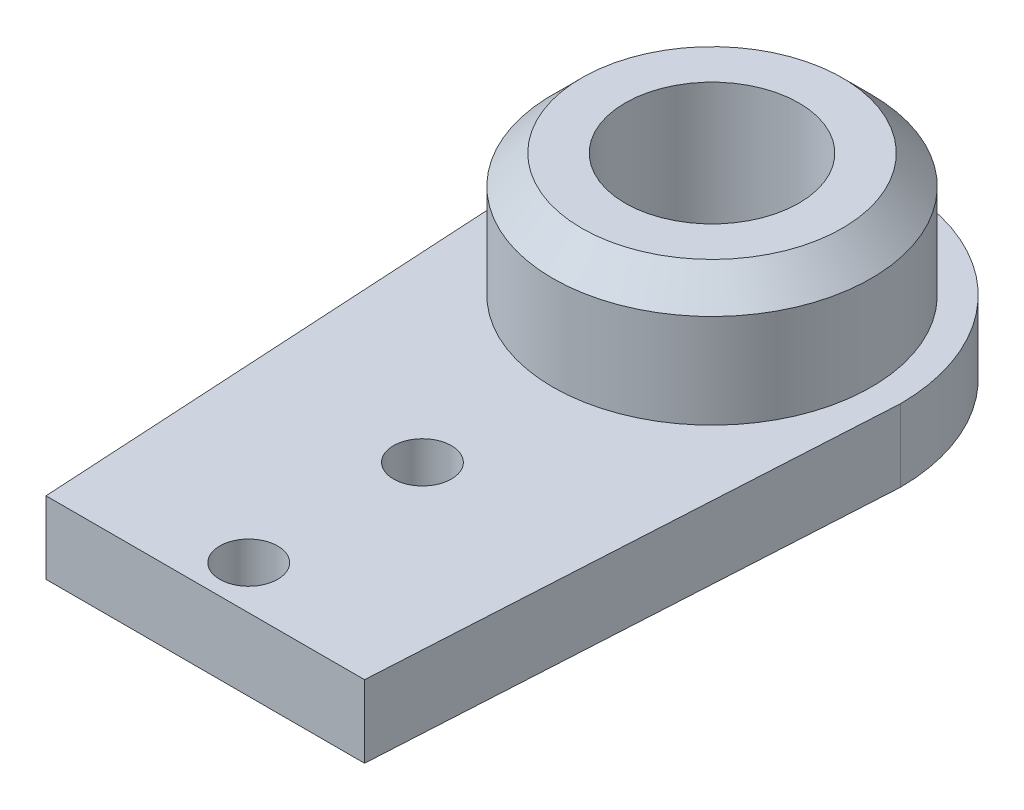
ISO-10303-21;
HEADER;
FILE_DESCRIPTION(('STEP AP214'),'2;1');
FILE_NAME('part.step','',(''),(''),'','','');
FILE_SCHEMA(('AUTOMOTIVE_DESIGN { 1 0 10303 214 1 1 1 1 }'));
ENDSEC;
DATA;
#1=APPLICATION_CONTEXT('core data for automotive mechanical design processes');
#2=APPLICATION_PROTOCOL_DEFINITION('international standard','automotive_design',2000,#1);
#3=PRODUCT_CONTEXT('',#1,'mechanical');
#4=PRODUCT('Part','Part','',(#3));
#5=PRODUCT_RELATED_PRODUCT_CATEGORY('part','',(#4));
#6=PRODUCT_DEFINITION_FORMATION('','',#4);
#7=PRODUCT_DEFINITION_CONTEXT('part definition',#1,'design');
#8=PRODUCT_DEFINITION('design','',#6,#7);
#9=PRODUCT_DEFINITION_SHAPE('','',#8);
#10=(LENGTH_UNIT() NAMED_UNIT(*) SI_UNIT(.MILLI.,.METRE.));
#11=(NAMED_UNIT(*) PLANE_ANGLE_UNIT() SI_UNIT($,.RADIAN.));
#12=(NAMED_UNIT(*) SI_UNIT($,.STERADIAN.) SOLID_ANGLE_UNIT());
#13=UNCERTAINTY_MEASURE_WITH_UNIT(LENGTH_MEASURE(1.E-05),#10,'distance_accuracy_value','');
#14=(GEOMETRIC_REPRESENTATION_CONTEXT(3) GLOBAL_UNCERTAINTY_ASSIGNED_CONTEXT((#13)) GLOBAL_UNIT_ASSIGNED_CONTEXT((#10,
#11,#12)) REPRESENTATION_CONTEXT('',''));
#15=CARTESIAN_POINT('',(0.,0.,0.));
#16=DIRECTION('',(0.,0.,1.));
#17=DIRECTION('',(1.,0.,0.));
#18=AXIS2_PLACEMENT_3D('',#15,#16,#17);
#19=CARTESIAN_POINT('',(0.,2.5,0.));
#20=DIRECTION('',(0.,1.,0.));
#21=DIRECTION('',(0.,0.,1.));
#22=AXIS2_PLACEMENT_3D('',#19,#20,#21);
#23=PLANE('',#22);
#24=CARTESIAN_POINT('',(0.,2.5,16.));
#25=DIRECTION('',(0.,1.,0.));
#26=DIRECTION('',(0.,0.,1.));
#27=AXIS2_PLACEMENT_3D('',#24,#25,#26);
#28=CIRCLE('',#27,1.);
#29=CARTESIAN_POINT('',(0.,2.5,17.));
#30=VERTEX_POINT('',#29);
#31=EDGE_CURVE('E117',#30,#30,#28,.T.);
#32=ORIENTED_EDGE('',*,*,#31,.F.);
#33=EDGE_LOOP('',(#32));
#34=FACE_BOUND('',#33,.T.);
#35=CARTESIAN_POINT('',(0.,2.5,10.));
#36=DIRECTION('',(0.,1.,0.));
#37=DIRECTION('',(0.,0.,1.));
#38=AXIS2_PLACEMENT_3D('',#35,#36,#37);
#39=CIRCLE('',#38,1.);
#40=CARTESIAN_POINT('',(0.,2.5,11.));
#41=VERTEX_POINT('',#40);
#42=EDGE_CURVE('E177',#41,#41,#39,.T.);
#43=ORIENTED_EDGE('',*,*,#42,.F.);
#44=EDGE_LOOP('',(#43));
#45=FACE_BOUND('',#44,.T.);
#46=DIRECTION('',(0.0570497905385129,0.,-0.998371334423977));
#47=VECTOR('',#46,1.);
#48=CARTESIAN_POINT('',(6.47884458909683,2.5,0.370219690805533));
#49=LINE('',#48,#47);
#50=CARTESIAN_POINT('',(5.5,2.5,17.5));
#51=VERTEX_POINT('',#50);
#52=CARTESIAN_POINT('',(6.5,2.5,0.));
#53=VERTEX_POINT('',#52);
#54=EDGE_CURVE('E89',#51,#53,#49,.T.);
#55=ORIENTED_EDGE('',*,*,#54,.T.);
#56=CARTESIAN_POINT('',(0.,2.5,0.));
#57=DIRECTION('',(0.,1.,0.));
#58=DIRECTION('',(0.,0.,1.));
#59=AXIS2_PLACEMENT_3D('',#56,#57,#58);
#60=CIRCLE('',#59,6.5);
#61=CARTESIAN_POINT('',(-6.5,2.5,0.));
#62=VERTEX_POINT('',#61);
#63=EDGE_CURVE('E84',#53,#62,#60,.T.);
#64=ORIENTED_EDGE('',*,*,#63,.T.);
#65=DIRECTION('',(0.0570497905385129,0.,0.998371334423977));
#66=VECTOR('',#65,1.);
#67=CARTESIAN_POINT('',(-6.47884458909683,2.5,0.370219690805533));
#68=LINE('',#67,#66);
#69=CARTESIAN_POINT('',(-5.5,2.5,17.5));
#70=VERTEX_POINT('',#69);
#71=EDGE_CURVE('E87',#62,#70,#68,.T.);
#72=ORIENTED_EDGE('',*,*,#71,.T.);
#73=DIRECTION('',(1.,0.,0.));
#74=VECTOR('',#73,1.);
#75=CARTESIAN_POINT('',(0.,2.5,17.5));
#76=LINE('',#75,#74);
#77=EDGE_CURVE('E53',#70,#51,#76,.T.);
#78=ORIENTED_EDGE('',*,*,#77,.T.);
#79=EDGE_LOOP('',(#55,#64,#72,#78));
#80=FACE_BOUND('',#79,.T.);
#81=CARTESIAN_POINT('',(0.,2.5,0.));
#82=DIRECTION('',(0.,1.,0.));
#83=DIRECTION('',(0.,0.,1.));
#84=AXIS2_PLACEMENT_3D('',#81,#82,#83);
#85=CIRCLE('',#84,5.5);
#86=CARTESIAN_POINT('',(0.,2.5,5.5));
#87=VERTEX_POINT('',#86);
#88=EDGE_CURVE('E108',#87,#87,#85,.T.);
#89=ORIENTED_EDGE('',*,*,#88,.F.);
#90=EDGE_LOOP('',(#89));
#91=FACE_BOUND('',#90,.T.);
#92=ADVANCED_FACE('F36',(#34,#45,#80,#91),#23,.T.);
#93=CARTESIAN_POINT('',(6.47884458909683,2.5,0.370219690805533));
#94=DIRECTION('',(-0.998371334423977,0.,-0.057049790538513));
#95=DIRECTION('',(-0.057049790538513,0.,0.998371334423977));
#96=AXIS2_PLACEMENT_3D('',#93,#94,#95);
#97=PLANE('',#96);
#98=DIRECTION('',(0.0570497905385129,0.,-0.998371334423977));
#99=VECTOR('',#98,1.);
#100=CARTESIAN_POINT('',(6.47884458909683,0.,0.370219690805533));
#101=LINE('',#100,#99);
#102=CARTESIAN_POINT('',(5.5,0.,17.5));
#103=VERTEX_POINT('',#102);
#104=CARTESIAN_POINT('',(6.5,0.,0.));
#105=VERTEX_POINT('',#104);
#106=EDGE_CURVE('E111',#103,#105,#101,.T.);
#107=ORIENTED_EDGE('',*,*,#106,.T.);
#108=DIRECTION('',(0.,-1.,0.));
#109=VECTOR('',#108,1.);
#110=CARTESIAN_POINT('',(6.5,2.5,0.));
#111=LINE('',#110,#109);
#112=EDGE_CURVE('E95',#53,#105,#111,.T.);
#113=ORIENTED_EDGE('',*,*,#112,.F.);
#114=ORIENTED_EDGE('',*,*,#54,.F.);
#115=DIRECTION('',(0.,-1.,0.));
#116=VECTOR('',#115,1.);
#117=CARTESIAN_POINT('',(5.5,2.5,17.5));
#118=LINE('',#117,#116);
#119=EDGE_CURVE('E100',#51,#103,#118,.T.);
#120=ORIENTED_EDGE('',*,*,#119,.T.);
#121=EDGE_LOOP('',(#107,#113,#114,#120));
#122=FACE_BOUND('',#121,.T.);
#123=ADVANCED_FACE('F137',(#122),#97,.F.);
#124=CARTESIAN_POINT('',(0.,2.5,0.));
#125=DIRECTION('',(0.,-1.,0.));
#126=DIRECTION('',(0.,0.,-1.));
#127=AXIS2_PLACEMENT_3D('',#124,#125,#126);
#128=CYLINDRICAL_SURFACE('',#127,6.5);
#129=CARTESIAN_POINT('',(0.,0.,0.));
#130=DIRECTION('',(0.,1.,0.));
#131=DIRECTION('',(0.,0.,1.));
#132=AXIS2_PLACEMENT_3D('',#129,#130,#131);
#133=CIRCLE('',#132,6.5);
#134=CARTESIAN_POINT('',(-6.5,0.,0.));
#135=VERTEX_POINT('',#134);
#136=EDGE_CURVE('E94',#105,#135,#133,.T.);
#137=ORIENTED_EDGE('',*,*,#136,.T.);
#138=DIRECTION('',(0.,-1.,0.));
#139=VECTOR('',#138,1.);
#140=CARTESIAN_POINT('',(-6.5,2.5,0.));
#141=LINE('',#140,#139);
#142=EDGE_CURVE('E92',#62,#135,#141,.T.);
#143=ORIENTED_EDGE('',*,*,#142,.F.);
#144=ORIENTED_EDGE('',*,*,#63,.F.);
#145=ORIENTED_EDGE('',*,*,#112,.T.);
#146=EDGE_LOOP('',(#137,#143,#144,#145));
#147=FACE_BOUND('',#146,.T.);
#148=ADVANCED_FACE('F93',(#147),#128,.T.);
#149=CARTESIAN_POINT('',(-6.47884458909683,2.5,0.370219690805533));
#150=DIRECTION('',(0.998371334423977,0.,-0.057049790538513));
#151=DIRECTION('',(-0.057049790538513,0.,-0.998371334423977));
#152=AXIS2_PLACEMENT_3D('',#149,#150,#151);
#153=PLANE('',#152);
#154=DIRECTION('',(0.0570497905385129,0.,0.998371334423977));
#155=VECTOR('',#154,1.);
#156=CARTESIAN_POINT('',(-6.47884458909683,0.,0.370219690805533));
#157=LINE('',#156,#155);
#158=CARTESIAN_POINT('',(-5.5,0.,17.5));
#159=VERTEX_POINT('',#158);
#160=EDGE_CURVE('E70',#135,#159,#157,.T.);
#161=ORIENTED_EDGE('',*,*,#160,.T.);
#162=DIRECTION('',(0.,-1.,0.));
#163=VECTOR('',#162,1.);
#164=CARTESIAN_POINT('',(-5.5,2.5,17.5));
#165=LINE('',#164,#163);
#166=EDGE_CURVE('E96',#70,#159,#165,.T.);
#167=ORIENTED_EDGE('',*,*,#166,.F.);
#168=ORIENTED_EDGE('',*,*,#71,.F.);
#169=ORIENTED_EDGE('',*,*,#142,.T.);
#170=EDGE_LOOP('',(#161,#167,#168,#169));
#171=FACE_BOUND('',#170,.T.);
#172=ADVANCED_FACE('F98',(#171),#153,.F.);
#173=CARTESIAN_POINT('',(0.,2.5,10.));
#174=DIRECTION('',(0.,-1.,0.));
#175=DIRECTION('',(0.,0.,-1.));
#176=AXIS2_PLACEMENT_3D('',#173,#174,#175);
#177=CYLINDRICAL_SURFACE('',#176,1.);
#178=ORIENTED_EDGE('',*,*,#42,.T.);
#179=EDGE_LOOP('',(#178));
#180=FACE_BOUND('',#179,.T.);
#181=CARTESIAN_POINT('',(0.,0.,10.));
#182=DIRECTION('',(0.,1.,0.));
#183=DIRECTION('',(0.,0.,1.));
#184=AXIS2_PLACEMENT_3D('',#181,#182,#183);
#185=CIRCLE('',#184,1.);
#186=CARTESIAN_POINT('',(0.,0.,11.));
#187=VERTEX_POINT('',#186);
#188=EDGE_CURVE('E107',#187,#187,#185,.T.);
#189=ORIENTED_EDGE('',*,*,#188,.F.);
#190=EDGE_LOOP('',(#189));
#191=FACE_BOUND('',#190,.T.);
#192=ADVANCED_FACE('F160',(#180,#191),#177,.F.);
#193=CARTESIAN_POINT('',(0.,2.5,16.));
#194=DIRECTION('',(0.,-1.,0.));
#195=DIRECTION('',(0.,0.,-1.));
#196=AXIS2_PLACEMENT_3D('',#193,#194,#195);
#197=CYLINDRICAL_SURFACE('',#196,1.);
#198=ORIENTED_EDGE('',*,*,#31,.T.);
#199=EDGE_LOOP('',(#198));
#200=FACE_BOUND('',#199,.T.);
#201=CARTESIAN_POINT('',(0.,0.,16.));
#202=DIRECTION('',(0.,1.,0.));
#203=DIRECTION('',(0.,0.,1.));
#204=AXIS2_PLACEMENT_3D('',#201,#202,#203);
#205=CIRCLE('',#204,1.);
#206=CARTESIAN_POINT('',(0.,0.,17.));
#207=VERTEX_POINT('',#206);
#208=EDGE_CURVE('E104',#207,#207,#205,.T.);
#209=ORIENTED_EDGE('',*,*,#208,.F.);
#210=EDGE_LOOP('',(#209));
#211=FACE_BOUND('',#210,.T.);
#212=ADVANCED_FACE('F157',(#200,#211),#197,.F.);
#213=CARTESIAN_POINT('',(0.,2.5,17.5));
#214=DIRECTION('',(0.,0.,-1.));
#215=DIRECTION('',(-1.,0.,0.));
#216=AXIS2_PLACEMENT_3D('',#213,#214,#215);
#217=PLANE('',#216);
#218=DIRECTION('',(1.,0.,0.));
#219=VECTOR('',#218,1.);
#220=CARTESIAN_POINT('',(0.,0.,17.5));
#221=LINE('',#220,#219);
#222=EDGE_CURVE('E76',#159,#103,#221,.T.);
#223=ORIENTED_EDGE('',*,*,#222,.T.);
#224=ORIENTED_EDGE('',*,*,#119,.F.);
#225=ORIENTED_EDGE('',*,*,#77,.F.);
#226=ORIENTED_EDGE('',*,*,#166,.T.);
#227=EDGE_LOOP('',(#223,#224,#225,#226));
#228=FACE_BOUND('',#227,.T.);
#229=ADVANCED_FACE('F153',(#228),#217,.F.);
#230=CARTESIAN_POINT('',(0.,0.,0.));
#231=DIRECTION('',(0.,1.,0.));
#232=DIRECTION('',(0.,0.,1.));
#233=AXIS2_PLACEMENT_3D('',#230,#231,#232);
#234=PLANE('',#233);
#235=CARTESIAN_POINT('',(0.,0.,0.));
#236=DIRECTION('',(0.,1.,0.));
#237=DIRECTION('',(0.,0.,1.));
#238=AXIS2_PLACEMENT_3D('',#235,#236,#237);
#239=CIRCLE('',#238,3.);
#240=CARTESIAN_POINT('',(0.,0.,3.));
#241=VERTEX_POINT('',#240);
#242=EDGE_CURVE('E187',#241,#241,#239,.F.);
#243=ORIENTED_EDGE('',*,*,#242,.F.);
#244=EDGE_LOOP('',(#243));
#245=FACE_BOUND('',#244,.T.);
#246=ORIENTED_EDGE('',*,*,#208,.T.);
#247=EDGE_LOOP('',(#246));
#248=FACE_BOUND('',#247,.T.);
#249=ORIENTED_EDGE('',*,*,#188,.T.);
#250=EDGE_LOOP('',(#249));
#251=FACE_BOUND('',#250,.T.);
#252=ORIENTED_EDGE('',*,*,#106,.F.);
#253=ORIENTED_EDGE('',*,*,#222,.F.);
#254=ORIENTED_EDGE('',*,*,#160,.F.);
#255=ORIENTED_EDGE('',*,*,#136,.F.);
#256=EDGE_LOOP('',(#252,#253,#254,#255));
#257=FACE_BOUND('',#256,.T.);
#258=ADVANCED_FACE('F150',(#245,#248,#251,#257),#234,.F.);
#259=CARTESIAN_POINT('',(0.,6.75,0.));
#260=DIRECTION('',(0.,1.,0.));
#261=DIRECTION('',(0.,0.,1.));
#262=AXIS2_PLACEMENT_3D('',#259,#260,#261);
#263=PLANE('',#262);
#264=CARTESIAN_POINT('',(0.,6.75,0.));
#265=DIRECTION('',(0.,1.,0.));
#266=DIRECTION('',(0.,0.,1.));
#267=AXIS2_PLACEMENT_3D('',#264,#265,#266);
#268=CIRCLE('',#267,4.5);
#269=CARTESIAN_POINT('',(0.,6.75,4.5));
#270=VERTEX_POINT('',#269);
#271=EDGE_CURVE('E45',#270,#270,#268,.T.);
#272=ORIENTED_EDGE('',*,*,#271,.T.);
#273=EDGE_LOOP('',(#272));
#274=FACE_BOUND('',#273,.T.);
#275=CARTESIAN_POINT('',(0.,6.75,0.));
#276=DIRECTION('',(0.,1.,0.));
#277=DIRECTION('',(0.,0.,1.));
#278=AXIS2_PLACEMENT_3D('',#275,#276,#277);
#279=CIRCLE('',#278,3.);
#280=CARTESIAN_POINT('',(0.,6.75,3.));
#281=VERTEX_POINT('',#280);
#282=EDGE_CURVE('E184',#281,#281,#279,.T.);
#283=ORIENTED_EDGE('',*,*,#282,.F.);
#284=EDGE_LOOP('',(#283));
#285=FACE_BOUND('',#284,.T.);
#286=ADVANCED_FACE('F123',(#274,#285),#263,.T.);
#287=CARTESIAN_POINT('',(0.,6.75,0.));
#288=DIRECTION('',(0.,-1.,0.));
#289=DIRECTION('',(0.,0.,-1.));
#290=AXIS2_PLACEMENT_3D('',#287,#288,#289);
#291=CYLINDRICAL_SURFACE('',#290,5.5);
#292=CARTESIAN_POINT('',(0.,5.75,0.));
#293=DIRECTION('',(0.,1.,0.));
#294=DIRECTION('',(0.,0.,1.));
#295=AXIS2_PLACEMENT_3D('',#292,#293,#294);
#296=CIRCLE('',#295,5.5);
#297=CARTESIAN_POINT('',(0.,5.75,5.5));
#298=VERTEX_POINT('',#297);
#299=EDGE_CURVE('E11',#298,#298,#296,.F.);
#300=ORIENTED_EDGE('',*,*,#299,.T.);
#301=EDGE_LOOP('',(#300));
#302=FACE_BOUND('',#301,.T.);
#303=ORIENTED_EDGE('',*,*,#88,.T.);
#304=EDGE_LOOP('',(#303));
#305=FACE_BOUND('',#304,.T.);
#306=ADVANCED_FACE('F132',(#302,#305),#291,.T.);
#307=CARTESIAN_POINT('',(0.,6.75,0.));
#308=DIRECTION('',(0.,-1.,0.));
#309=DIRECTION('',(0.,0.,-1.));
#310=AXIS2_PLACEMENT_3D('',#307,#308,#309);
#311=CYLINDRICAL_SURFACE('',#310,3.);
#312=ORIENTED_EDGE('',*,*,#282,.T.);
#313=EDGE_LOOP('',(#312));
#314=FACE_BOUND('',#313,.T.);
#315=ORIENTED_EDGE('',*,*,#242,.T.);
#316=EDGE_LOOP('',(#315));
#317=FACE_BOUND('',#316,.T.);
#318=ADVANCED_FACE('F127',(#314,#317),#311,.F.);
#319=CARTESIAN_POINT('',(0.,6.75,0.));
#320=DIRECTION('',(0.,-1.,0.));
#321=DIRECTION('',(0.,0.,-1.));
#322=AXIS2_PLACEMENT_3D('',#319,#320,#321);
#323=CONICAL_SURFACE('',#322,4.5,0.785398163397447);
#324=ORIENTED_EDGE('',*,*,#299,.F.);
#325=EDGE_LOOP('',(#324));
#326=FACE_BOUND('',#325,.T.);
#327=ORIENTED_EDGE('',*,*,#271,.F.);
#328=EDGE_LOOP('',(#327));
#329=FACE_BOUND('',#328,.T.);
#330=ADVANCED_FACE('F38',(#326,#329),#323,.T.);
#331=CLOSED_SHELL('',(#92,#123,#148,#172,#192,#212,#229,#258,#286,#306,#318,#330));
#332=MANIFOLD_SOLID_BREP('B2',#331);
#333=ADVANCED_BREP_SHAPE_REPRESENTATION('',(#18,#332),#14);
#334=SHAPE_DEFINITION_REPRESENTATION(#9,#333);
ENDSEC;
END-ISO-10303-21;
